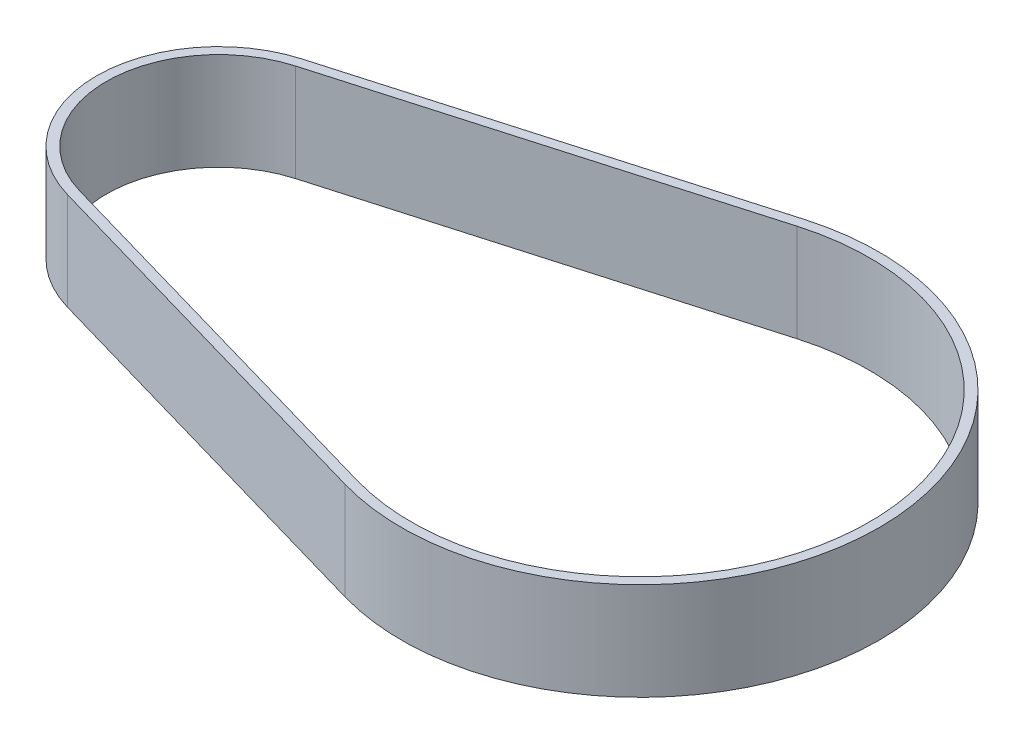
ISO-10303-21;
HEADER;
FILE_DESCRIPTION(('STEP AP214'),'2;1');
FILE_NAME('part.step','',(''),(''),'','','');
FILE_SCHEMA(('AUTOMOTIVE_DESIGN { 1 0 10303 214 1 1 1 1 }'));
ENDSEC;
DATA;
#1=APPLICATION_CONTEXT('core data for automotive mechanical design processes');
#2=APPLICATION_PROTOCOL_DEFINITION('international standard','automotive_design',2000,#1);
#3=PRODUCT_CONTEXT('',#1,'mechanical');
#4=PRODUCT('Part','Part','',(#3));
#5=PRODUCT_RELATED_PRODUCT_CATEGORY('part','',(#4));
#6=PRODUCT_DEFINITION_FORMATION('','',#4);
#7=PRODUCT_DEFINITION_CONTEXT('part definition',#1,'design');
#8=PRODUCT_DEFINITION('design','',#6,#7);
#9=PRODUCT_DEFINITION_SHAPE('','',#8);
#10=(LENGTH_UNIT() NAMED_UNIT(*) SI_UNIT(.MILLI.,.METRE.));
#11=(NAMED_UNIT(*) PLANE_ANGLE_UNIT() SI_UNIT($,.RADIAN.));
#12=(NAMED_UNIT(*) SI_UNIT($,.STERADIAN.) SOLID_ANGLE_UNIT());
#13=UNCERTAINTY_MEASURE_WITH_UNIT(LENGTH_MEASURE(1.E-05),#10,'distance_accuracy_value','');
#14=(GEOMETRIC_REPRESENTATION_CONTEXT(3) GLOBAL_UNCERTAINTY_ASSIGNED_CONTEXT((#13)) GLOBAL_UNIT_ASSIGNED_CONTEXT((#10,
#11,#12)) REPRESENTATION_CONTEXT('',''));
#15=CARTESIAN_POINT('',(0.,0.,0.));
#16=DIRECTION('',(0.,0.,1.));
#17=DIRECTION('',(1.,0.,0.));
#18=AXIS2_PLACEMENT_3D('',#15,#16,#17);
#19=CARTESIAN_POINT('',(-1.5,0.,0.));
#20=DIRECTION('',(0.,1.,0.));
#21=DIRECTION('',(0.,0.,1.));
#22=AXIS2_PLACEMENT_3D('',#19,#20,#21);
#23=CYLINDRICAL_SURFACE('',#22,12.525);
#24=DIRECTION('',(0.,1.,0.));
#25=VECTOR('',#24,1.);
#26=CARTESIAN_POINT('',(-4.96240692680481,0.,-12.0369166846493));
#27=LINE('',#26,#25);
#28=CARTESIAN_POINT('',(-4.96240692680465,0.,-12.0369166846497));
#29=VERTEX_POINT('',#28);
#30=CARTESIAN_POINT('',(-4.96240692680465,10.,-12.0369166846497));
#31=VERTEX_POINT('',#30);
#32=EDGE_CURVE('E84',#29,#31,#27,.T.);
#33=ORIENTED_EDGE('',*,*,#32,.F.);
#34=CARTESIAN_POINT('',(-1.5,0.,0.));
#35=DIRECTION('',(0.,1.,0.));
#36=DIRECTION('',(0.,0.,1.));
#37=AXIS2_PLACEMENT_3D('',#34,#35,#36);
#38=CIRCLE('',#37,12.525);
#39=CARTESIAN_POINT('',(-4.96240692680474,0.,12.0369166846501));
#40=VERTEX_POINT('',#39);
#41=EDGE_CURVE('E142',#29,#40,#38,.T.);
#42=ORIENTED_EDGE('',*,*,#41,.T.);
#43=DIRECTION('',(0.,1.,0.));
#44=VECTOR('',#43,1.);
#45=CARTESIAN_POINT('',(-4.962406926805,0.,12.03691668465));
#46=LINE('',#45,#44);
#47=CARTESIAN_POINT('',(-4.96240692680485,10.,12.03691668465));
#48=VERTEX_POINT('',#47);
#49=EDGE_CURVE('E86',#48,#40,#46,.F.);
#50=ORIENTED_EDGE('',*,*,#49,.F.);
#51=CARTESIAN_POINT('',(-1.5,10.,0.));
#52=DIRECTION('',(0.,1.,0.));
#53=DIRECTION('',(0.,0.,1.));
#54=AXIS2_PLACEMENT_3D('',#51,#52,#53);
#55=CIRCLE('',#54,12.525);
#56=EDGE_CURVE('E22',#31,#48,#55,.T.);
#57=ORIENTED_EDGE('',*,*,#56,.F.);
#58=EDGE_LOOP('',(#33,#42,#50,#57));
#59=FACE_BOUND('',#58,.T.);
#60=ADVANCED_FACE('F19',(#59),#23,.T.);
#61=CARTESIAN_POINT('',(41.72823780223,0.,0.));
#62=DIRECTION('',(0.,1.,0.));
#63=DIRECTION('',(0.,0.,1.));
#64=AXIS2_PLACEMENT_3D('',#61,#62,#63);
#65=CYLINDRICAL_SURFACE('',#64,23.475);
#66=CARTESIAN_POINT('',(41.72823780223,10.,0.));
#67=DIRECTION('',(0.,1.,0.));
#68=DIRECTION('',(0.,0.,1.));
#69=AXIS2_PLACEMENT_3D('',#66,#67,#68);
#70=CIRCLE('',#69,23.475);
#71=CARTESIAN_POINT('',(35.2388164364213,10.,-22.56020911554));
#72=VERTEX_POINT('',#71);
#73=CARTESIAN_POINT('',(35.2388164364212,10.,22.5602091155403));
#74=VERTEX_POINT('',#73);
#75=EDGE_CURVE('E145',#72,#74,#70,.F.);
#76=ORIENTED_EDGE('',*,*,#75,.F.);
#77=DIRECTION('',(0.,1.,0.));
#78=VECTOR('',#77,1.);
#79=CARTESIAN_POINT('',(35.2388164364202,0.,-22.5602091155394));
#80=LINE('',#79,#78);
#81=CARTESIAN_POINT('',(35.2388164364213,0.,-22.56020911554));
#82=VERTEX_POINT('',#81);
#83=EDGE_CURVE('E118',#82,#72,#80,.T.);
#84=ORIENTED_EDGE('',*,*,#83,.F.);
#85=CARTESIAN_POINT('',(41.72823780223,0.,0.));
#86=DIRECTION('',(0.,1.,0.));
#87=DIRECTION('',(0.,0.,1.));
#88=AXIS2_PLACEMENT_3D('',#85,#86,#87);
#89=CIRCLE('',#88,23.475);
#90=CARTESIAN_POINT('',(35.2388164364212,0.,22.5602091155403));
#91=VERTEX_POINT('',#90);
#92=EDGE_CURVE('E139',#82,#91,#89,.F.);
#93=ORIENTED_EDGE('',*,*,#92,.T.);
#94=DIRECTION('',(0.,1.,0.));
#95=VECTOR('',#94,1.);
#96=CARTESIAN_POINT('',(35.23881643642,0.,22.56020911554));
#97=LINE('',#96,#95);
#98=EDGE_CURVE('E124',#74,#91,#97,.F.);
#99=ORIENTED_EDGE('',*,*,#98,.F.);
#100=EDGE_LOOP('',(#76,#84,#93,#99));
#101=FACE_BOUND('',#100,.T.);
#102=ADVANCED_FACE('F188',(#101),#65,.F.);
#103=CARTESIAN_POINT('',(35.23881643642,0.,22.56020911554));
#104=DIRECTION('',(0.276439674794793,0.,-0.961031272227574));
#105=DIRECTION('',(-0.961031272227574,0.,-0.276439674794793));
#106=AXIS2_PLACEMENT_3D('',#103,#104,#105);
#107=PLANE('',#106);
#108=ORIENTED_EDGE('',*,*,#98,.T.);
#109=DIRECTION('',(-0.96103127222757,0.,-0.276439674794808));
#110=VECTOR('',#109,1.);
#111=CARTESIAN_POINT('',(35.23881643642,0.,22.56020911554));
#112=LINE('',#111,#110);
#113=CARTESIAN_POINT('',(-4.68596725201008,0.,11.0758854124214));
#114=VERTEX_POINT('',#113);
#115=EDGE_CURVE('E138',#91,#114,#112,.T.);
#116=ORIENTED_EDGE('',*,*,#115,.T.);
#117=DIRECTION('',(0.,1.,0.));
#118=VECTOR('',#117,1.);
#119=CARTESIAN_POINT('',(-4.68596725201074,0.,11.0758854124226));
#120=LINE('',#119,#118);
#121=CARTESIAN_POINT('',(-4.68596725201008,10.,11.0758854124214));
#122=VERTEX_POINT('',#121);
#123=EDGE_CURVE('E121',#114,#122,#120,.T.);
#124=ORIENTED_EDGE('',*,*,#123,.T.);
#125=DIRECTION('',(-0.96103127222757,0.,-0.276439674794808));
#126=VECTOR('',#125,1.);
#127=CARTESIAN_POINT('',(35.23881643642,10.,22.56020911554));
#128=LINE('',#127,#126);
#129=EDGE_CURVE('E105',#74,#122,#128,.T.);
#130=ORIENTED_EDGE('',*,*,#129,.F.);
#131=EDGE_LOOP('',(#108,#116,#124,#130));
#132=FACE_BOUND('',#131,.T.);
#133=ADVANCED_FACE('F191',(#132),#107,.T.);
#134=CARTESIAN_POINT('',(-1.5,0.,0.));
#135=DIRECTION('',(0.,1.,0.));
#136=DIRECTION('',(0.,0.,1.));
#137=AXIS2_PLACEMENT_3D('',#134,#135,#136);
#138=CYLINDRICAL_SURFACE('',#137,11.525);
#139=CARTESIAN_POINT('',(-1.5,10.,0.));
#140=DIRECTION('',(0.,1.,0.));
#141=DIRECTION('',(0.,0.,1.));
#142=AXIS2_PLACEMENT_3D('',#139,#140,#141);
#143=CIRCLE('',#142,11.525);
#144=CARTESIAN_POINT('',(-4.68596725200971,10.,-11.0758854124201));
#145=VERTEX_POINT('',#144);
#146=EDGE_CURVE('E111',#122,#145,#143,.F.);
#147=ORIENTED_EDGE('',*,*,#146,.F.);
#148=ORIENTED_EDGE('',*,*,#123,.F.);
#149=CARTESIAN_POINT('',(-1.5,0.,0.));
#150=DIRECTION('',(0.,1.,0.));
#151=DIRECTION('',(0.,0.,1.));
#152=AXIS2_PLACEMENT_3D('',#149,#150,#151);
#153=CIRCLE('',#152,11.525);
#154=CARTESIAN_POINT('',(-4.68596725200971,0.,-11.0758854124201));
#155=VERTEX_POINT('',#154);
#156=EDGE_CURVE('E134',#114,#155,#153,.F.);
#157=ORIENTED_EDGE('',*,*,#156,.T.);
#158=DIRECTION('',(0.,1.,0.));
#159=VECTOR('',#158,1.);
#160=CARTESIAN_POINT('',(-4.68596725201,0.,-11.07588541242));
#161=LINE('',#160,#159);
#162=EDGE_CURVE('E99',#145,#155,#161,.F.);
#163=ORIENTED_EDGE('',*,*,#162,.F.);
#164=EDGE_LOOP('',(#147,#148,#157,#163));
#165=FACE_BOUND('',#164,.T.);
#166=ADVANCED_FACE('F241',(#165),#138,.F.);
#167=CARTESIAN_POINT('',(-4.68596725201,0.,-11.07588541242));
#168=DIRECTION('',(0.276439674794793,0.,0.961031272227574));
#169=DIRECTION('',(0.961031272227574,0.,-0.276439674794793));
#170=AXIS2_PLACEMENT_3D('',#167,#168,#169);
#171=PLANE('',#170);
#172=ORIENTED_EDGE('',*,*,#162,.T.);
#173=DIRECTION('',(0.96103127222757,0.,-0.276439674794808));
#174=VECTOR('',#173,1.);
#175=CARTESIAN_POINT('',(-4.68596725201,0.,-11.07588541242));
#176=LINE('',#175,#174);
#177=EDGE_CURVE('E137',#155,#82,#176,.T.);
#178=ORIENTED_EDGE('',*,*,#177,.T.);
#179=ORIENTED_EDGE('',*,*,#83,.T.);
#180=DIRECTION('',(0.96103127222757,0.,-0.276439674794808));
#181=VECTOR('',#180,1.);
#182=CARTESIAN_POINT('',(-4.68596725201,10.,-11.07588541242));
#183=LINE('',#182,#181);
#184=EDGE_CURVE('E148',#145,#72,#183,.T.);
#185=ORIENTED_EDGE('',*,*,#184,.F.);
#186=EDGE_LOOP('',(#172,#178,#179,#185));
#187=FACE_BOUND('',#186,.T.);
#188=ADVANCED_FACE('F180',(#187),#171,.T.);
#189=CARTESIAN_POINT('',(34.96237676163,0.,-23.52124038777));
#190=DIRECTION('',(-0.276439674794793,0.,-0.961031272227574));
#191=DIRECTION('',(-0.961031272227574,0.,0.276439674794793));
#192=AXIS2_PLACEMENT_3D('',#189,#190,#191);
#193=PLANE('',#192);
#194=DIRECTION('',(0.,1.,0.));
#195=VECTOR('',#194,1.);
#196=CARTESIAN_POINT('',(34.9623767616298,0.,-23.5212403877706));
#197=LINE('',#196,#195);
#198=CARTESIAN_POINT('',(34.9623767616289,0.,-23.52124038777));
#199=VERTEX_POINT('',#198);
#200=CARTESIAN_POINT('',(34.9623767616289,10.,-23.52124038777));
#201=VERTEX_POINT('',#200);
#202=EDGE_CURVE('E133',#199,#201,#197,.T.);
#203=ORIENTED_EDGE('',*,*,#202,.F.);
#204=DIRECTION('',(-0.961031272227579,0.,0.276439674794776));
#205=VECTOR('',#204,1.);
#206=CARTESIAN_POINT('',(34.96237676163,0.,-23.52124038777));
#207=LINE('',#206,#205);
#208=EDGE_CURVE('E96',#199,#29,#207,.T.);
#209=ORIENTED_EDGE('',*,*,#208,.T.);
#210=ORIENTED_EDGE('',*,*,#32,.T.);
#211=DIRECTION('',(-0.961031272227579,0.,0.276439674794776));
#212=VECTOR('',#211,1.);
#213=CARTESIAN_POINT('',(34.96237676163,10.,-23.52124038777));
#214=LINE('',#213,#212);
#215=EDGE_CURVE('E91',#201,#31,#214,.T.);
#216=ORIENTED_EDGE('',*,*,#215,.F.);
#217=EDGE_LOOP('',(#203,#209,#210,#216));
#218=FACE_BOUND('',#217,.T.);
#219=ADVANCED_FACE('F93',(#218),#193,.T.);
#220=CARTESIAN_POINT('',(0.,10.,0.));
#221=DIRECTION('',(0.,1.,0.));
#222=DIRECTION('',(0.,0.,1.));
#223=AXIS2_PLACEMENT_3D('',#220,#221,#222);
#224=PLANE('',#223);
#225=ORIENTED_EDGE('',*,*,#184,.T.);
#226=ORIENTED_EDGE('',*,*,#75,.T.);
#227=ORIENTED_EDGE('',*,*,#129,.T.);
#228=ORIENTED_EDGE('',*,*,#146,.T.);
#229=EDGE_LOOP('',(#225,#226,#227,#228));
#230=FACE_BOUND('',#229,.T.);
#231=CARTESIAN_POINT('',(41.72823780223,10.,0.));
#232=DIRECTION('',(0.,1.,0.));
#233=DIRECTION('',(0.,0.,1.));
#234=AXIS2_PLACEMENT_3D('',#231,#232,#233);
#235=CIRCLE('',#234,24.475);
#236=CARTESIAN_POINT('',(34.9623767616286,10.,23.5212403877703));
#237=VERTEX_POINT('',#236);
#238=EDGE_CURVE('E102',#201,#237,#235,.F.);
#239=ORIENTED_EDGE('',*,*,#238,.F.);
#240=ORIENTED_EDGE('',*,*,#215,.T.);
#241=ORIENTED_EDGE('',*,*,#56,.T.);
#242=DIRECTION('',(0.961031272227574,0.,0.276439674794793));
#243=VECTOR('',#242,1.);
#244=CARTESIAN_POINT('',(-4.962406926805,10.,12.03691668465));
#245=LINE('',#244,#243);
#246=EDGE_CURVE('E128',#237,#48,#245,.F.);
#247=ORIENTED_EDGE('',*,*,#246,.F.);
#248=EDGE_LOOP('',(#239,#240,#241,#247));
#249=FACE_BOUND('',#248,.T.);
#250=ADVANCED_FACE('F100',(#230,#249),#224,.T.);
#251=CARTESIAN_POINT('',(-4.962406926805,0.,12.03691668465));
#252=DIRECTION('',(-0.276439674794793,0.,0.961031272227574));
#253=DIRECTION('',(0.961031272227574,0.,0.276439674794793));
#254=AXIS2_PLACEMENT_3D('',#251,#252,#253);
#255=PLANE('',#254);
#256=ORIENTED_EDGE('',*,*,#49,.T.);
#257=DIRECTION('',(0.961031272227579,0.,0.276439674794776));
#258=VECTOR('',#257,1.);
#259=CARTESIAN_POINT('',(-4.962406926805,0.,12.03691668465));
#260=LINE('',#259,#258);
#261=CARTESIAN_POINT('',(34.9623767616289,0.,23.52124038777));
#262=VERTEX_POINT('',#261);
#263=EDGE_CURVE('E38',#40,#262,#260,.T.);
#264=ORIENTED_EDGE('',*,*,#263,.T.);
#265=DIRECTION('',(0.,1.,0.));
#266=VECTOR('',#265,1.);
#267=CARTESIAN_POINT('',(34.9623767616298,0.,23.5212403877706));
#268=LINE('',#267,#266);
#269=EDGE_CURVE('E29',#237,#262,#268,.F.);
#270=ORIENTED_EDGE('',*,*,#269,.F.);
#271=ORIENTED_EDGE('',*,*,#246,.T.);
#272=EDGE_LOOP('',(#256,#264,#270,#271));
#273=FACE_BOUND('',#272,.T.);
#274=ADVANCED_FACE('F194',(#273),#255,.T.);
#275=CARTESIAN_POINT('',(0.,0.,0.));
#276=DIRECTION('',(0.,1.,0.));
#277=DIRECTION('',(0.,0.,1.));
#278=AXIS2_PLACEMENT_3D('',#275,#276,#277);
#279=PLANE('',#278);
#280=ORIENTED_EDGE('',*,*,#156,.F.);
#281=ORIENTED_EDGE('',*,*,#115,.F.);
#282=ORIENTED_EDGE('',*,*,#92,.F.);
#283=ORIENTED_EDGE('',*,*,#177,.F.);
#284=EDGE_LOOP('',(#280,#281,#282,#283));
#285=FACE_BOUND('',#284,.T.);
#286=ORIENTED_EDGE('',*,*,#263,.F.);
#287=ORIENTED_EDGE('',*,*,#41,.F.);
#288=ORIENTED_EDGE('',*,*,#208,.F.);
#289=CARTESIAN_POINT('',(41.72823780223,0.,0.));
#290=DIRECTION('',(0.,1.,0.));
#291=DIRECTION('',(0.,0.,1.));
#292=AXIS2_PLACEMENT_3D('',#289,#290,#291);
#293=CIRCLE('',#292,24.475);
#294=EDGE_CURVE('E12',#262,#199,#293,.T.);
#295=ORIENTED_EDGE('',*,*,#294,.F.);
#296=EDGE_LOOP('',(#286,#287,#288,#295));
#297=FACE_BOUND('',#296,.T.);
#298=ADVANCED_FACE('F185',(#285,#297),#279,.F.);
#299=CARTESIAN_POINT('',(41.72823780223,0.,0.));
#300=DIRECTION('',(0.,1.,0.));
#301=DIRECTION('',(0.,0.,1.));
#302=AXIS2_PLACEMENT_3D('',#299,#300,#301);
#303=CYLINDRICAL_SURFACE('',#302,24.475);
#304=ORIENTED_EDGE('',*,*,#269,.T.);
#305=ORIENTED_EDGE('',*,*,#294,.T.);
#306=ORIENTED_EDGE('',*,*,#202,.T.);
#307=ORIENTED_EDGE('',*,*,#238,.T.);
#308=EDGE_LOOP('',(#304,#305,#306,#307));
#309=FACE_BOUND('',#308,.T.);
#310=ADVANCED_FACE('F203',(#309),#303,.T.);
#311=CLOSED_SHELL('',(#60,#102,#133,#166,#188,#219,#250,#274,#298,#310));
#312=MANIFOLD_SOLID_BREP('B1',#311);
#313=ADVANCED_BREP_SHAPE_REPRESENTATION('',(#18,#312),#14);
#314=SHAPE_DEFINITION_REPRESENTATION(#9,#313);
ENDSEC;
END-ISO-10303-21;
